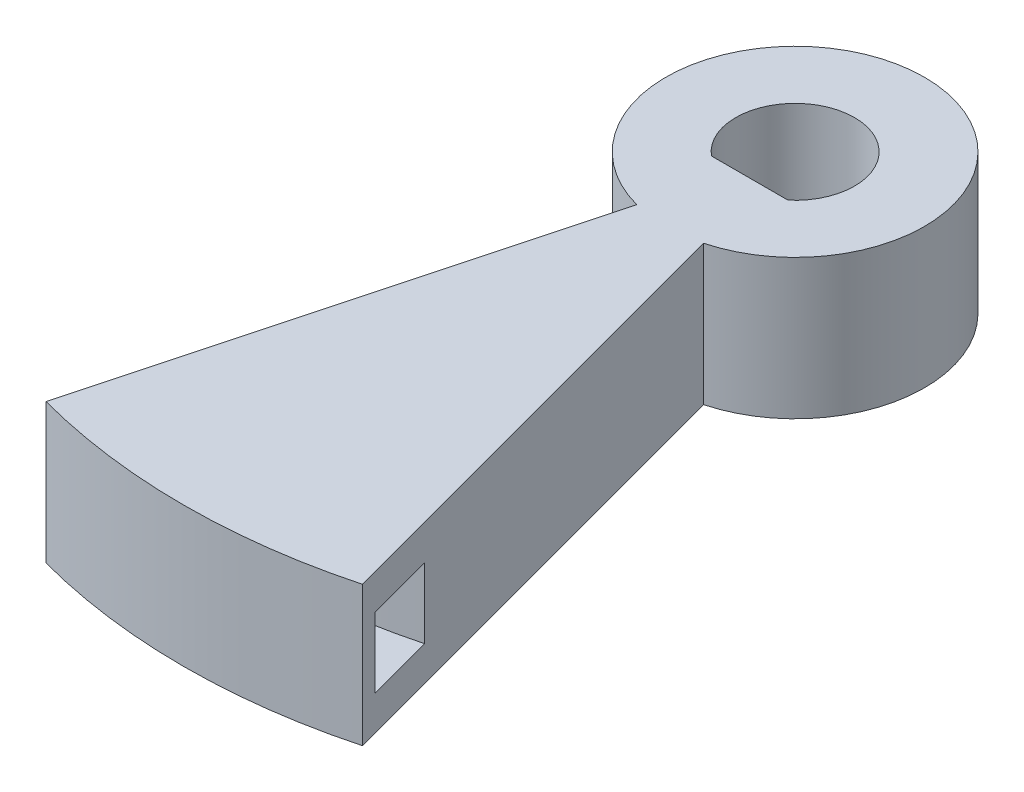
ISO-10303-21;
HEADER;
FILE_DESCRIPTION(('STEP AP214'),'2;1');
FILE_NAME('part.step','',(''),(''),'','','');
FILE_SCHEMA(('AUTOMOTIVE_DESIGN { 1 0 10303 214 1 1 1 1 }'));
ENDSEC;
DATA;
#1=APPLICATION_CONTEXT('core data for automotive mechanical design processes');
#2=APPLICATION_PROTOCOL_DEFINITION('international standard','automotive_design',2000,#1);
#3=PRODUCT_CONTEXT('',#1,'mechanical');
#4=PRODUCT('Part','Part','',(#3));
#5=PRODUCT_RELATED_PRODUCT_CATEGORY('part','',(#4));
#6=PRODUCT_DEFINITION_FORMATION('','',#4);
#7=PRODUCT_DEFINITION_CONTEXT('part definition',#1,'design');
#8=PRODUCT_DEFINITION('design','',#6,#7);
#9=PRODUCT_DEFINITION_SHAPE('','',#8);
#10=(LENGTH_UNIT() NAMED_UNIT(*) SI_UNIT(.MILLI.,.METRE.));
#11=(NAMED_UNIT(*) PLANE_ANGLE_UNIT() SI_UNIT($,.RADIAN.));
#12=(NAMED_UNIT(*) SI_UNIT($,.STERADIAN.) SOLID_ANGLE_UNIT());
#13=UNCERTAINTY_MEASURE_WITH_UNIT(LENGTH_MEASURE(1.E-05),#10,'distance_accuracy_value','');
#14=(GEOMETRIC_REPRESENTATION_CONTEXT(3) GLOBAL_UNCERTAINTY_ASSIGNED_CONTEXT((#13)) GLOBAL_UNIT_ASSIGNED_CONTEXT((#10,
#11,#12)) REPRESENTATION_CONTEXT('',''));
#15=CARTESIAN_POINT('',(0.,0.,0.));
#16=DIRECTION('',(0.,0.,1.));
#17=DIRECTION('',(1.,0.,0.));
#18=AXIS2_PLACEMENT_3D('',#15,#16,#17);
#19=CARTESIAN_POINT('',(0.,4.,0.));
#20=DIRECTION('',(0.,-1.,0.));
#21=DIRECTION('',(0.,0.,-1.));
#22=AXIS2_PLACEMENT_3D('',#19,#20,#21);
#23=CYLINDRICAL_SURFACE('',#22,1.7);
#24=DIRECTION('',(0.,-1.,0.));
#25=VECTOR('',#24,1.);
#26=CARTESIAN_POINT('',(1.09544511501033,4.,1.3));
#27=LINE('',#26,#25);
#28=CARTESIAN_POINT('',(1.09544511501033,4.,1.3));
#29=VERTEX_POINT('',#28);
#30=CARTESIAN_POINT('',(1.09544511501033,0.,1.3));
#31=VERTEX_POINT('',#30);
#32=EDGE_CURVE('E128',#29,#31,#27,.T.);
#33=ORIENTED_EDGE('',*,*,#32,.F.);
#34=CARTESIAN_POINT('',(0.,4.,0.));
#35=DIRECTION('',(0.,1.,0.));
#36=DIRECTION('',(0.,0.,-1.));
#37=AXIS2_PLACEMENT_3D('',#34,#35,#36);
#38=CIRCLE('',#37,1.7);
#39=CARTESIAN_POINT('',(-1.09544511501033,4.,1.3));
#40=VERTEX_POINT('',#39);
#41=EDGE_CURVE('E56',#29,#40,#38,.T.);
#42=ORIENTED_EDGE('',*,*,#41,.T.);
#43=DIRECTION('',(0.,-1.,0.));
#44=VECTOR('',#43,1.);
#45=CARTESIAN_POINT('',(-1.09544511501033,4.,1.3));
#46=LINE('',#45,#44);
#47=CARTESIAN_POINT('',(-1.09544511501033,0.,1.3));
#48=VERTEX_POINT('',#47);
#49=EDGE_CURVE('E126',#40,#48,#46,.T.);
#50=ORIENTED_EDGE('',*,*,#49,.T.);
#51=CARTESIAN_POINT('',(0.,0.,0.));
#52=DIRECTION('',(0.,1.,0.));
#53=DIRECTION('',(0.,0.,-1.));
#54=AXIS2_PLACEMENT_3D('',#51,#52,#53);
#55=CIRCLE('',#54,1.7);
#56=EDGE_CURVE('E255',#31,#48,#55,.T.);
#57=ORIENTED_EDGE('',*,*,#56,.F.);
#58=EDGE_LOOP('',(#33,#42,#50,#57));
#59=FACE_BOUND('',#58,.T.);
#60=ADVANCED_FACE('F43',(#59),#23,.F.);
#61=CARTESIAN_POINT('',(0.,4.,1.3));
#62=DIRECTION('',(0.,0.,-1.));
#63=DIRECTION('',(-1.,0.,0.));
#64=AXIS2_PLACEMENT_3D('',#61,#62,#63);
#65=PLANE('',#64);
#66=ORIENTED_EDGE('',*,*,#49,.F.);
#67=DIRECTION('',(1.,0.,0.));
#68=VECTOR('',#67,1.);
#69=CARTESIAN_POINT('',(-1.09544511501033,4.,1.3));
#70=LINE('',#69,#68);
#71=EDGE_CURVE('E117',#40,#29,#70,.T.);
#72=ORIENTED_EDGE('',*,*,#71,.T.);
#73=ORIENTED_EDGE('',*,*,#32,.T.);
#74=DIRECTION('',(1.,0.,0.));
#75=VECTOR('',#74,1.);
#76=CARTESIAN_POINT('',(0.,0.,1.3));
#77=LINE('',#76,#75);
#78=EDGE_CURVE('E132',#48,#31,#77,.T.);
#79=ORIENTED_EDGE('',*,*,#78,.F.);
#80=EDGE_LOOP('',(#66,#72,#73,#79));
#81=FACE_BOUND('',#80,.T.);
#82=ADVANCED_FACE('F130',(#81),#65,.T.);
#83=CARTESIAN_POINT('',(0.,12.5,0.));
#84=DIRECTION('',(0.,-1.,0.));
#85=DIRECTION('',(0.,0.,-1.));
#86=AXIS2_PLACEMENT_3D('',#83,#84,#85);
#87=CYLINDRICAL_SURFACE('',#86,3.7);
#88=CARTESIAN_POINT('',(0.,4.,0.));
#89=DIRECTION('',(0.,1.,0.));
#90=DIRECTION('',(0.,0.,1.));
#91=AXIS2_PLACEMENT_3D('',#88,#89,#90);
#92=CIRCLE('',#91,3.7);
#93=CARTESIAN_POINT('',(0.957630466879331,4.,3.57392555726955));
#94=VERTEX_POINT('',#93);
#95=CARTESIAN_POINT('',(-0.95763046687933,4.,3.57392555726955));
#96=VERTEX_POINT('',#95);
#97=EDGE_CURVE('E122',#94,#96,#92,.T.);
#98=ORIENTED_EDGE('',*,*,#97,.F.);
#99=DIRECTION('',(0.,1.,0.));
#100=VECTOR('',#99,1.);
#101=CARTESIAN_POINT('',(0.957630466879333,0.,3.57392555726955));
#102=LINE('',#101,#100);
#103=CARTESIAN_POINT('',(0.95763046687933,0.,3.57392555726955));
#104=VERTEX_POINT('',#103);
#105=EDGE_CURVE('E250',#104,#94,#102,.T.);
#106=ORIENTED_EDGE('',*,*,#105,.F.);
#107=CARTESIAN_POINT('',(0.,0.,0.));
#108=DIRECTION('',(0.,-1.,0.));
#109=DIRECTION('',(0.,0.,-1.));
#110=AXIS2_PLACEMENT_3D('',#107,#108,#109);
#111=CIRCLE('',#110,3.7);
#112=CARTESIAN_POINT('',(-0.95763046687933,0.,3.57392555726955));
#113=VERTEX_POINT('',#112);
#114=EDGE_CURVE('E191',#113,#104,#111,.T.);
#115=ORIENTED_EDGE('',*,*,#114,.F.);
#116=DIRECTION('',(0.,1.,0.));
#117=VECTOR('',#116,1.);
#118=CARTESIAN_POINT('',(-0.95763046687933,0.,3.57392555726955));
#119=LINE('',#118,#117);
#120=EDGE_CURVE('E193',#113,#96,#119,.T.);
#121=ORIENTED_EDGE('',*,*,#120,.T.);
#122=EDGE_LOOP('',(#98,#106,#115,#121));
#123=FACE_BOUND('',#122,.T.);
#124=ADVANCED_FACE('F232',(#123),#87,.T.);
#125=CARTESIAN_POINT('',(0.,6.,0.));
#126=DIRECTION('',(0.965925826289068,0.,-0.258819045102522));
#127=DIRECTION('',(-0.258819045102522,0.,-0.965925826289068));
#128=AXIS2_PLACEMENT_3D('',#125,#126,#127);
#129=PLANE('',#128);
#130=DIRECTION('',(0.,1.,0.));
#131=VECTOR('',#130,1.);
#132=CARTESIAN_POINT('',(4.39992376674287,1.,16.4207390469142));
#133=LINE('',#132,#131);
#134=CARTESIAN_POINT('',(4.39992376674287,1.,16.4207390469142));
#135=VERTEX_POINT('',#134);
#136=CARTESIAN_POINT('',(4.39992376674287,3.,16.4207390469142));
#137=VERTEX_POINT('',#136);
#138=EDGE_CURVE('E171',#135,#137,#133,.T.);
#139=ORIENTED_EDGE('',*,*,#138,.T.);
#140=DIRECTION('',(-0.258819045102522,0.,-0.965925826289068));
#141=VECTOR('',#140,1.);
#142=CARTESIAN_POINT('',(0.,3.,0.));
#143=LINE('',#142,#141);
#144=CARTESIAN_POINT('',(3.88228567653782,3.,14.488887394336));
#145=VERTEX_POINT('',#144);
#146=EDGE_CURVE('E206',#137,#145,#143,.T.);
#147=ORIENTED_EDGE('',*,*,#146,.T.);
#148=DIRECTION('',(0.,1.,0.));
#149=VECTOR('',#148,1.);
#150=CARTESIAN_POINT('',(3.88228567653782,1.,14.488887394336));
#151=LINE('',#150,#149);
#152=CARTESIAN_POINT('',(3.88228567653782,1.,14.488887394336));
#153=VERTEX_POINT('',#152);
#154=EDGE_CURVE('E11',#153,#145,#151,.T.);
#155=ORIENTED_EDGE('',*,*,#154,.F.);
#156=DIRECTION('',(-0.258819045102522,0.,-0.965925826289068));
#157=VECTOR('',#156,1.);
#158=CARTESIAN_POINT('',(0.,1.,0.));
#159=LINE('',#158,#157);
#160=EDGE_CURVE('E208',#135,#153,#159,.T.);
#161=ORIENTED_EDGE('',*,*,#160,.F.);
#162=EDGE_LOOP('',(#139,#147,#155,#161));
#163=FACE_BOUND('',#162,.T.);
#164=DIRECTION('',(0.258819045102522,0.,0.965925826289068));
#165=VECTOR('',#164,1.);
#166=CARTESIAN_POINT('',(0.,0.,0.));
#167=LINE('',#166,#165);
#168=CARTESIAN_POINT('',(4.52933328929413,0.,16.9037019600587));
#169=VERTEX_POINT('',#168);
#170=EDGE_CURVE('E64',#104,#169,#167,.T.);
#171=ORIENTED_EDGE('',*,*,#170,.F.);
#172=ORIENTED_EDGE('',*,*,#105,.T.);
#173=DIRECTION('',(-0.258819045102522,0.,-0.965925826289068));
#174=VECTOR('',#173,1.);
#175=CARTESIAN_POINT('',(0.,4.,0.));
#176=LINE('',#175,#174);
#177=CARTESIAN_POINT('',(4.52933328929413,4.,16.9037019600587));
#178=VERTEX_POINT('',#177);
#179=EDGE_CURVE('E167',#178,#94,#176,.T.);
#180=ORIENTED_EDGE('',*,*,#179,.F.);
#181=DIRECTION('',(0.,-1.,0.));
#182=VECTOR('',#181,1.);
#183=CARTESIAN_POINT('',(4.52933328929413,6.,16.9037019600587));
#184=LINE('',#183,#182);
#185=EDGE_CURVE('E163',#178,#169,#184,.T.);
#186=ORIENTED_EDGE('',*,*,#185,.T.);
#187=EDGE_LOOP('',(#171,#172,#180,#186));
#188=FACE_BOUND('',#187,.T.);
#189=ADVANCED_FACE('F195',(#163,#188),#129,.T.);
#190=CARTESIAN_POINT('',(0.,6.,0.));
#191=DIRECTION('',(0.965925826289068,0.,0.258819045102522));
#192=DIRECTION('',(0.258819045102522,0.,-0.965925826289068));
#193=AXIS2_PLACEMENT_3D('',#190,#191,#192);
#194=PLANE('',#193);
#195=DIRECTION('',(0.258819045102522,0.,-0.965925826289068));
#196=VECTOR('',#195,1.);
#197=CARTESIAN_POINT('',(0.,1.,0.));
#198=LINE('',#197,#196);
#199=CARTESIAN_POINT('',(-4.39992376674287,1.,16.4207390469142));
#200=VERTEX_POINT('',#199);
#201=CARTESIAN_POINT('',(-3.88228567653782,1.,14.488887394336));
#202=VERTEX_POINT('',#201);
#203=EDGE_CURVE('E150',#200,#202,#198,.T.);
#204=ORIENTED_EDGE('',*,*,#203,.T.);
#205=DIRECTION('',(0.,1.,0.));
#206=VECTOR('',#205,1.);
#207=CARTESIAN_POINT('',(-3.88228567653782,1.,14.488887394336));
#208=LINE('',#207,#206);
#209=CARTESIAN_POINT('',(-3.88228567653782,3.,14.488887394336));
#210=VERTEX_POINT('',#209);
#211=EDGE_CURVE('E50',#202,#210,#208,.T.);
#212=ORIENTED_EDGE('',*,*,#211,.T.);
#213=DIRECTION('',(0.258819045102522,0.,-0.965925826289068));
#214=VECTOR('',#213,1.);
#215=CARTESIAN_POINT('',(0.,3.,0.));
#216=LINE('',#215,#214);
#217=CARTESIAN_POINT('',(-4.39992376674287,3.,16.4207390469142));
#218=VERTEX_POINT('',#217);
#219=EDGE_CURVE('E147',#218,#210,#216,.T.);
#220=ORIENTED_EDGE('',*,*,#219,.F.);
#221=DIRECTION('',(0.,1.,0.));
#222=VECTOR('',#221,1.);
#223=CARTESIAN_POINT('',(-4.39992376674287,1.,16.4207390469142));
#224=LINE('',#223,#222);
#225=EDGE_CURVE('E201',#200,#218,#224,.T.);
#226=ORIENTED_EDGE('',*,*,#225,.F.);
#227=EDGE_LOOP('',(#204,#212,#220,#226));
#228=FACE_BOUND('',#227,.T.);
#229=ORIENTED_EDGE('',*,*,#120,.F.);
#230=DIRECTION('',(-0.258819045102522,0.,0.965925826289068));
#231=VECTOR('',#230,1.);
#232=CARTESIAN_POINT('',(0.,0.,0.));
#233=LINE('',#232,#231);
#234=CARTESIAN_POINT('',(-4.52933328929413,0.,16.9037019600587));
#235=VERTEX_POINT('',#234);
#236=EDGE_CURVE('E188',#113,#235,#233,.T.);
#237=ORIENTED_EDGE('',*,*,#236,.T.);
#238=DIRECTION('',(0.,-1.,0.));
#239=VECTOR('',#238,1.);
#240=CARTESIAN_POINT('',(-4.52933328929413,6.,16.9037019600587));
#241=LINE('',#240,#239);
#242=CARTESIAN_POINT('',(-4.52933328929413,4.,16.9037019600587));
#243=VERTEX_POINT('',#242);
#244=EDGE_CURVE('E185',#243,#235,#241,.T.);
#245=ORIENTED_EDGE('',*,*,#244,.F.);
#246=DIRECTION('',(0.258819045102522,0.,-0.965925826289068));
#247=VECTOR('',#246,1.);
#248=CARTESIAN_POINT('',(0.,4.,0.));
#249=LINE('',#248,#247);
#250=EDGE_CURVE('E203',#243,#96,#249,.T.);
#251=ORIENTED_EDGE('',*,*,#250,.T.);
#252=EDGE_LOOP('',(#229,#237,#245,#251));
#253=FACE_BOUND('',#252,.T.);
#254=ADVANCED_FACE('F145',(#228,#253),#194,.F.);
#255=CARTESIAN_POINT('',(0.,4.,0.));
#256=DIRECTION('',(0.,1.,0.));
#257=DIRECTION('',(0.,0.,1.));
#258=AXIS2_PLACEMENT_3D('',#255,#256,#257);
#259=PLANE('',#258);
#260=CARTESIAN_POINT('',(0.,4.,0.));
#261=DIRECTION('',(0.,1.,0.));
#262=DIRECTION('',(0.,0.,1.));
#263=AXIS2_PLACEMENT_3D('',#260,#261,#262);
#264=CIRCLE('',#263,17.5);
#265=EDGE_CURVE('E134',#243,#178,#264,.T.);
#266=ORIENTED_EDGE('',*,*,#265,.T.);
#267=ORIENTED_EDGE('',*,*,#179,.T.);
#268=ORIENTED_EDGE('',*,*,#97,.T.);
#269=ORIENTED_EDGE('',*,*,#250,.F.);
#270=EDGE_LOOP('',(#266,#267,#268,#269));
#271=FACE_BOUND('',#270,.T.);
#272=ORIENTED_EDGE('',*,*,#71,.F.);
#273=ORIENTED_EDGE('',*,*,#41,.F.);
#274=EDGE_LOOP('',(#272,#273));
#275=FACE_BOUND('',#274,.T.);
#276=ADVANCED_FACE('F118',(#271,#275),#259,.T.);
#277=CARTESIAN_POINT('',(0.,4.,0.));
#278=DIRECTION('',(0.,-1.,0.));
#279=DIRECTION('',(0.,0.,-1.));
#280=AXIS2_PLACEMENT_3D('',#277,#278,#279);
#281=CYLINDRICAL_SURFACE('',#280,17.5);
#282=ORIENTED_EDGE('',*,*,#185,.F.);
#283=ORIENTED_EDGE('',*,*,#265,.F.);
#284=ORIENTED_EDGE('',*,*,#244,.T.);
#285=CARTESIAN_POINT('',(0.,0.,0.));
#286=DIRECTION('',(0.,1.,0.));
#287=DIRECTION('',(0.,0.,1.));
#288=AXIS2_PLACEMENT_3D('',#285,#286,#287);
#289=CIRCLE('',#288,17.5);
#290=EDGE_CURVE('E138',#235,#169,#289,.T.);
#291=ORIENTED_EDGE('',*,*,#290,.T.);
#292=EDGE_LOOP('',(#282,#283,#284,#291));
#293=FACE_BOUND('',#292,.T.);
#294=ADVANCED_FACE('F183',(#293),#281,.T.);
#295=CARTESIAN_POINT('',(0.,0.,0.));
#296=DIRECTION('',(0.,1.,0.));
#297=DIRECTION('',(0.,0.,1.));
#298=AXIS2_PLACEMENT_3D('',#295,#296,#297);
#299=PLANE('',#298);
#300=ORIENTED_EDGE('',*,*,#114,.T.);
#301=ORIENTED_EDGE('',*,*,#170,.T.);
#302=ORIENTED_EDGE('',*,*,#290,.F.);
#303=ORIENTED_EDGE('',*,*,#236,.F.);
#304=EDGE_LOOP('',(#300,#301,#302,#303));
#305=FACE_BOUND('',#304,.T.);
#306=ORIENTED_EDGE('',*,*,#78,.T.);
#307=ORIENTED_EDGE('',*,*,#56,.T.);
#308=EDGE_LOOP('',(#306,#307));
#309=FACE_BOUND('',#308,.T.);
#310=ADVANCED_FACE('F187',(#305,#309),#299,.F.);
#311=CARTESIAN_POINT('',(0.,1.,0.));
#312=DIRECTION('',(0.,1.,0.));
#313=DIRECTION('',(0.,0.,1.));
#314=AXIS2_PLACEMENT_3D('',#311,#312,#313);
#315=CYLINDRICAL_SURFACE('',#314,17.);
#316=ORIENTED_EDGE('',*,*,#138,.F.);
#317=CARTESIAN_POINT('',(0.,1.,0.));
#318=DIRECTION('',(0.,1.,0.));
#319=DIRECTION('',(0.,0.,1.));
#320=AXIS2_PLACEMENT_3D('',#317,#318,#319);
#321=CIRCLE('',#320,17.);
#322=EDGE_CURVE('E174',#200,#135,#321,.T.);
#323=ORIENTED_EDGE('',*,*,#322,.F.);
#324=ORIENTED_EDGE('',*,*,#225,.T.);
#325=CARTESIAN_POINT('',(0.,3.,0.));
#326=DIRECTION('',(0.,1.,0.));
#327=DIRECTION('',(0.,0.,1.));
#328=AXIS2_PLACEMENT_3D('',#325,#326,#327);
#329=CIRCLE('',#328,17.);
#330=EDGE_CURVE('E162',#218,#137,#329,.T.);
#331=ORIENTED_EDGE('',*,*,#330,.T.);
#332=EDGE_LOOP('',(#316,#323,#324,#331));
#333=FACE_BOUND('',#332,.T.);
#334=ADVANCED_FACE('F215',(#333),#315,.F.);
#335=CARTESIAN_POINT('',(0.,1.,0.));
#336=DIRECTION('',(0.,1.,0.));
#337=DIRECTION('',(0.,0.,1.));
#338=AXIS2_PLACEMENT_3D('',#335,#336,#337);
#339=PLANE('',#338);
#340=ORIENTED_EDGE('',*,*,#322,.T.);
#341=ORIENTED_EDGE('',*,*,#160,.T.);
#342=CARTESIAN_POINT('',(0.,1.,0.));
#343=DIRECTION('',(0.,1.,0.));
#344=DIRECTION('',(0.,0.,1.));
#345=AXIS2_PLACEMENT_3D('',#342,#343,#344);
#346=CIRCLE('',#345,15.);
#347=EDGE_CURVE('E166',#202,#153,#346,.T.);
#348=ORIENTED_EDGE('',*,*,#347,.F.);
#349=ORIENTED_EDGE('',*,*,#203,.F.);
#350=EDGE_LOOP('',(#340,#341,#348,#349));
#351=FACE_BOUND('',#350,.T.);
#352=ADVANCED_FACE('F217',(#351),#339,.T.);
#353=CARTESIAN_POINT('',(0.,3.,0.));
#354=DIRECTION('',(0.,1.,0.));
#355=DIRECTION('',(0.,0.,1.));
#356=AXIS2_PLACEMENT_3D('',#353,#354,#355);
#357=PLANE('',#356);
#358=ORIENTED_EDGE('',*,*,#146,.F.);
#359=ORIENTED_EDGE('',*,*,#330,.F.);
#360=ORIENTED_EDGE('',*,*,#219,.T.);
#361=CARTESIAN_POINT('',(0.,3.,0.));
#362=DIRECTION('',(0.,1.,0.));
#363=DIRECTION('',(0.,0.,1.));
#364=AXIS2_PLACEMENT_3D('',#361,#362,#363);
#365=CIRCLE('',#364,15.);
#366=EDGE_CURVE('E160',#210,#145,#365,.T.);
#367=ORIENTED_EDGE('',*,*,#366,.T.);
#368=EDGE_LOOP('',(#358,#359,#360,#367));
#369=FACE_BOUND('',#368,.T.);
#370=ADVANCED_FACE('F159',(#369),#357,.F.);
#371=CARTESIAN_POINT('',(0.,1.,0.));
#372=DIRECTION('',(0.,1.,0.));
#373=DIRECTION('',(0.,0.,1.));
#374=AXIS2_PLACEMENT_3D('',#371,#372,#373);
#375=CYLINDRICAL_SURFACE('',#374,15.);
#376=ORIENTED_EDGE('',*,*,#347,.T.);
#377=ORIENTED_EDGE('',*,*,#154,.T.);
#378=ORIENTED_EDGE('',*,*,#366,.F.);
#379=ORIENTED_EDGE('',*,*,#211,.F.);
#380=EDGE_LOOP('',(#376,#377,#378,#379));
#381=FACE_BOUND('',#380,.T.);
#382=ADVANCED_FACE('F165',(#381),#375,.T.);
#383=CLOSED_SHELL('',(#60,#82,#124,#189,#254,#276,#294,#310,#334,#352,#370,#382));
#384=MANIFOLD_SOLID_BREP('B2',#383);
#385=ADVANCED_BREP_SHAPE_REPRESENTATION('',(#18,#384),#14);
#386=SHAPE_DEFINITION_REPRESENTATION(#9,#385);
ENDSEC;
END-ISO-10303-21;
